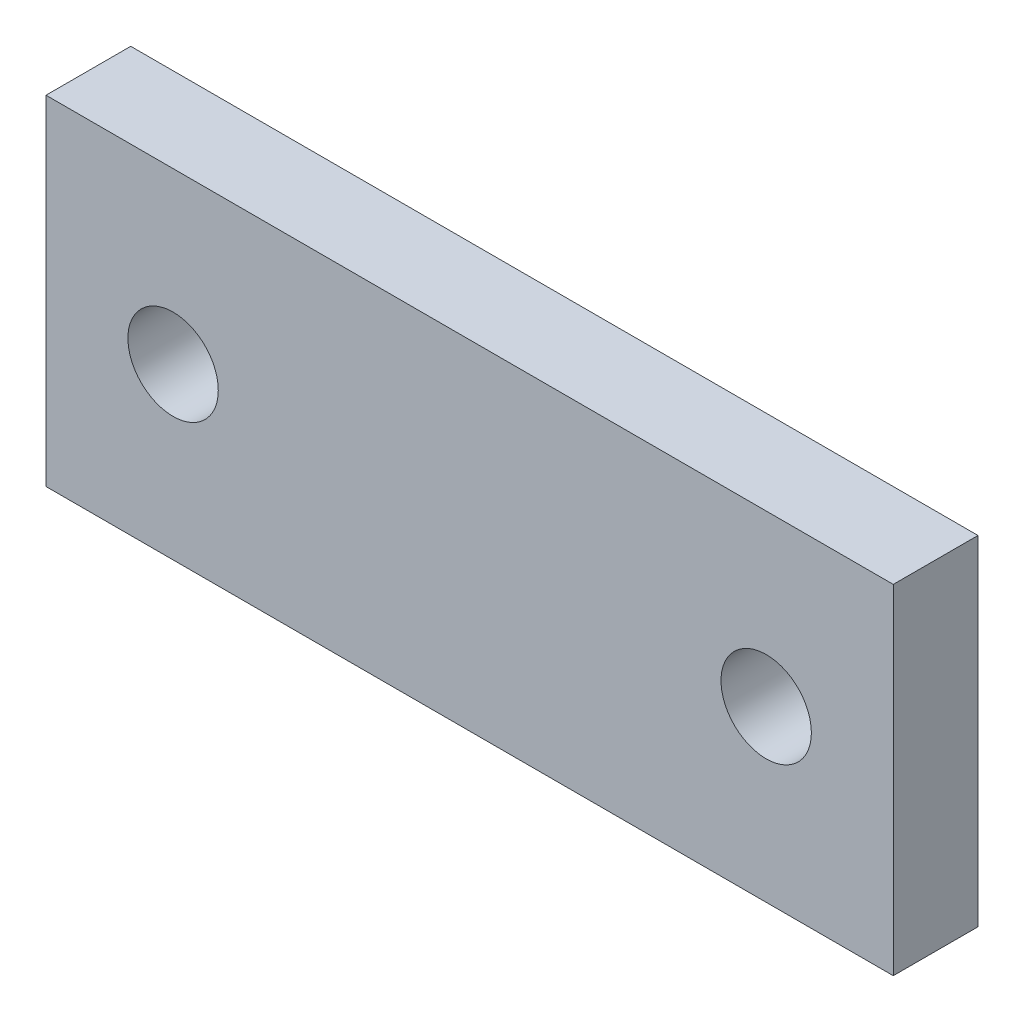
ISO-10303-21;
HEADER;
FILE_DESCRIPTION(('STEP AP214'),'2;1');
FILE_NAME('part.step','',(''),(''),'','','');
FILE_SCHEMA(('AUTOMOTIVE_DESIGN { 1 0 10303 214 1 1 1 1 }'));
ENDSEC;
DATA;
#1=APPLICATION_CONTEXT('core data for automotive mechanical design processes');
#2=APPLICATION_PROTOCOL_DEFINITION('international standard','automotive_design',2000,#1);
#3=PRODUCT_CONTEXT('',#1,'mechanical');
#4=PRODUCT('Part','Part','',(#3));
#5=PRODUCT_RELATED_PRODUCT_CATEGORY('part','',(#4));
#6=PRODUCT_DEFINITION_FORMATION('','',#4);
#7=PRODUCT_DEFINITION_CONTEXT('part definition',#1,'design');
#8=PRODUCT_DEFINITION('design','',#6,#7);
#9=PRODUCT_DEFINITION_SHAPE('','',#8);
#10=(LENGTH_UNIT() NAMED_UNIT(*) SI_UNIT(.MILLI.,.METRE.));
#11=(NAMED_UNIT(*) PLANE_ANGLE_UNIT() SI_UNIT($,.RADIAN.));
#12=(NAMED_UNIT(*) SI_UNIT($,.STERADIAN.) SOLID_ANGLE_UNIT());
#13=UNCERTAINTY_MEASURE_WITH_UNIT(LENGTH_MEASURE(1.E-05),#10,'distance_accuracy_value','');
#14=(GEOMETRIC_REPRESENTATION_CONTEXT(3) GLOBAL_UNCERTAINTY_ASSIGNED_CONTEXT((#13)) GLOBAL_UNIT_ASSIGNED_CONTEXT((#10,
#11,#12)) REPRESENTATION_CONTEXT('',''));
#15=CARTESIAN_POINT('',(0.,0.,0.));
#16=DIRECTION('',(0.,0.,1.));
#17=DIRECTION('',(1.,0.,0.));
#18=AXIS2_PLACEMENT_3D('',#15,#16,#17);
#19=CARTESIAN_POINT('',(0.,0.,3.));
#20=DIRECTION('',(0.,0.,1.));
#21=DIRECTION('',(1.,0.,0.));
#22=AXIS2_PLACEMENT_3D('',#19,#20,#21);
#23=PLANE('',#22);
#24=CARTESIAN_POINT('',(-0.780588843214674,6.,3.));
#25=DIRECTION('',(0.,0.,1.));
#26=DIRECTION('',(1.,0.,0.));
#27=AXIS2_PLACEMENT_3D('',#24,#25,#26);
#28=CIRCLE('',#27,1.6);
#29=CARTESIAN_POINT('',(0.819411156785326,6.,3.));
#30=VERTEX_POINT('',#29);
#31=EDGE_CURVE('E112',#30,#30,#28,.T.);
#32=ORIENTED_EDGE('',*,*,#31,.F.);
#33=EDGE_LOOP('',(#32));
#34=FACE_BOUND('',#33,.T.);
#35=DIRECTION('',(0.,1.,0.));
#36=VECTOR('',#35,1.);
#37=CARTESIAN_POINT('',(24.7194111567853,0.,3.));
#38=LINE('',#37,#36);
#39=CARTESIAN_POINT('',(24.7194111567853,0.,3.));
#40=VERTEX_POINT('',#39);
#41=CARTESIAN_POINT('',(24.7194111567853,12.,3.));
#42=VERTEX_POINT('',#41);
#43=EDGE_CURVE('E92',#40,#42,#38,.T.);
#44=ORIENTED_EDGE('',*,*,#43,.T.);
#45=DIRECTION('',(-1.,0.,0.));
#46=VECTOR('',#45,1.);
#47=CARTESIAN_POINT('',(24.7194111567853,12.,3.));
#48=LINE('',#47,#46);
#49=CARTESIAN_POINT('',(-5.28058884321467,12.,3.));
#50=VERTEX_POINT('',#49);
#51=EDGE_CURVE('E86',#42,#50,#48,.T.);
#52=ORIENTED_EDGE('',*,*,#51,.T.);
#53=DIRECTION('',(0.,-1.,0.));
#54=VECTOR('',#53,1.);
#55=CARTESIAN_POINT('',(-5.28058884321467,0.,3.));
#56=LINE('',#55,#54);
#57=CARTESIAN_POINT('',(-5.28058884321467,0.,3.));
#58=VERTEX_POINT('',#57);
#59=EDGE_CURVE('E90',#50,#58,#56,.T.);
#60=ORIENTED_EDGE('',*,*,#59,.T.);
#61=DIRECTION('',(1.,0.,0.));
#62=VECTOR('',#61,1.);
#63=CARTESIAN_POINT('',(24.7194111567853,0.,3.));
#64=LINE('',#63,#62);
#65=EDGE_CURVE('E56',#58,#40,#64,.T.);
#66=ORIENTED_EDGE('',*,*,#65,.T.);
#67=EDGE_LOOP('',(#44,#52,#60,#66));
#68=FACE_BOUND('',#67,.T.);
#69=CARTESIAN_POINT('',(20.2194111567853,6.,3.));
#70=DIRECTION('',(0.,0.,1.));
#71=DIRECTION('',(1.,0.,0.));
#72=AXIS2_PLACEMENT_3D('',#69,#70,#71);
#73=CIRCLE('',#72,1.6);
#74=CARTESIAN_POINT('',(21.8194111567853,6.,3.));
#75=VERTEX_POINT('',#74);
#76=EDGE_CURVE('E129',#75,#75,#73,.T.);
#77=ORIENTED_EDGE('',*,*,#76,.F.);
#78=EDGE_LOOP('',(#77));
#79=FACE_BOUND('',#78,.T.);
#80=ADVANCED_FACE('F39',(#34,#68,#79),#23,.T.);
#81=CARTESIAN_POINT('',(0.,0.,0.));
#82=DIRECTION('',(0.,0.,1.));
#83=DIRECTION('',(1.,0.,0.));
#84=AXIS2_PLACEMENT_3D('',#81,#82,#83);
#85=PLANE('',#84);
#86=CARTESIAN_POINT('',(-0.780588843214674,6.,0.));
#87=DIRECTION('',(0.,0.,1.));
#88=DIRECTION('',(1.,0.,0.));
#89=AXIS2_PLACEMENT_3D('',#86,#87,#88);
#90=CIRCLE('',#89,1.6);
#91=CARTESIAN_POINT('',(0.819411156785326,6.,0.));
#92=VERTEX_POINT('',#91);
#93=EDGE_CURVE('E125',#92,#92,#90,.T.);
#94=ORIENTED_EDGE('',*,*,#93,.T.);
#95=EDGE_LOOP('',(#94));
#96=FACE_BOUND('',#95,.T.);
#97=DIRECTION('',(0.,1.,0.));
#98=VECTOR('',#97,1.);
#99=CARTESIAN_POINT('',(24.7194111567853,0.,0.));
#100=LINE('',#99,#98);
#101=CARTESIAN_POINT('',(24.7194111567853,0.,0.));
#102=VERTEX_POINT('',#101);
#103=CARTESIAN_POINT('',(24.7194111567853,12.,0.));
#104=VERTEX_POINT('',#103);
#105=EDGE_CURVE('E109',#102,#104,#100,.T.);
#106=ORIENTED_EDGE('',*,*,#105,.F.);
#107=DIRECTION('',(1.,0.,0.));
#108=VECTOR('',#107,1.);
#109=CARTESIAN_POINT('',(24.7194111567853,0.,0.));
#110=LINE('',#109,#108);
#111=CARTESIAN_POINT('',(-5.28058884321467,0.,0.));
#112=VERTEX_POINT('',#111);
#113=EDGE_CURVE('E79',#112,#102,#110,.T.);
#114=ORIENTED_EDGE('',*,*,#113,.F.);
#115=DIRECTION('',(0.,-1.,0.));
#116=VECTOR('',#115,1.);
#117=CARTESIAN_POINT('',(-5.28058884321467,0.,0.));
#118=LINE('',#117,#116);
#119=CARTESIAN_POINT('',(-5.28058884321467,12.,0.));
#120=VERTEX_POINT('',#119);
#121=EDGE_CURVE('E73',#120,#112,#118,.T.);
#122=ORIENTED_EDGE('',*,*,#121,.F.);
#123=DIRECTION('',(-1.,0.,0.));
#124=VECTOR('',#123,1.);
#125=CARTESIAN_POINT('',(24.7194111567853,12.,0.));
#126=LINE('',#125,#124);
#127=EDGE_CURVE('E97',#104,#120,#126,.T.);
#128=ORIENTED_EDGE('',*,*,#127,.F.);
#129=EDGE_LOOP('',(#106,#114,#122,#128));
#130=FACE_BOUND('',#129,.T.);
#131=CARTESIAN_POINT('',(20.2194111567853,6.,0.));
#132=DIRECTION('',(0.,0.,1.));
#133=DIRECTION('',(1.,0.,0.));
#134=AXIS2_PLACEMENT_3D('',#131,#132,#133);
#135=CIRCLE('',#134,1.6);
#136=CARTESIAN_POINT('',(21.8194111567853,6.,0.));
#137=VERTEX_POINT('',#136);
#138=EDGE_CURVE('E133',#137,#137,#135,.T.);
#139=ORIENTED_EDGE('',*,*,#138,.T.);
#140=EDGE_LOOP('',(#139));
#141=FACE_BOUND('',#140,.T.);
#142=ADVANCED_FACE('F121',(#96,#130,#141),#85,.F.);
#143=CARTESIAN_POINT('',(24.7194111567853,0.,3.));
#144=DIRECTION('',(-1.,0.,0.));
#145=DIRECTION('',(0.,0.,1.));
#146=AXIS2_PLACEMENT_3D('',#143,#144,#145);
#147=PLANE('',#146);
#148=ORIENTED_EDGE('',*,*,#105,.T.);
#149=DIRECTION('',(0.,0.,-1.));
#150=VECTOR('',#149,1.);
#151=CARTESIAN_POINT('',(24.7194111567853,12.,3.));
#152=LINE('',#151,#150);
#153=EDGE_CURVE('E11',#42,#104,#152,.T.);
#154=ORIENTED_EDGE('',*,*,#153,.F.);
#155=ORIENTED_EDGE('',*,*,#43,.F.);
#156=DIRECTION('',(0.,0.,-1.));
#157=VECTOR('',#156,1.);
#158=CARTESIAN_POINT('',(24.7194111567853,0.,3.));
#159=LINE('',#158,#157);
#160=EDGE_CURVE('E105',#40,#102,#159,.T.);
#161=ORIENTED_EDGE('',*,*,#160,.T.);
#162=EDGE_LOOP('',(#148,#154,#155,#161));
#163=FACE_BOUND('',#162,.T.);
#164=ADVANCED_FACE('F41',(#163),#147,.F.);
#165=CARTESIAN_POINT('',(24.7194111567853,12.,3.));
#166=DIRECTION('',(0.,-1.,0.));
#167=DIRECTION('',(0.,0.,-1.));
#168=AXIS2_PLACEMENT_3D('',#165,#166,#167);
#169=PLANE('',#168);
#170=ORIENTED_EDGE('',*,*,#127,.T.);
#171=DIRECTION('',(0.,0.,-1.));
#172=VECTOR('',#171,1.);
#173=CARTESIAN_POINT('',(-5.28058884321467,12.,3.));
#174=LINE('',#173,#172);
#175=EDGE_CURVE('E48',#50,#120,#174,.T.);
#176=ORIENTED_EDGE('',*,*,#175,.F.);
#177=ORIENTED_EDGE('',*,*,#51,.F.);
#178=ORIENTED_EDGE('',*,*,#153,.T.);
#179=EDGE_LOOP('',(#170,#176,#177,#178));
#180=FACE_BOUND('',#179,.T.);
#181=ADVANCED_FACE('F96',(#180),#169,.F.);
#182=CARTESIAN_POINT('',(-5.28058884321467,0.,3.));
#183=DIRECTION('',(1.,0.,0.));
#184=DIRECTION('',(0.,0.,-1.));
#185=AXIS2_PLACEMENT_3D('',#182,#183,#184);
#186=PLANE('',#185);
#187=ORIENTED_EDGE('',*,*,#121,.T.);
#188=DIRECTION('',(0.,0.,-1.));
#189=VECTOR('',#188,1.);
#190=CARTESIAN_POINT('',(-5.28058884321467,0.,3.));
#191=LINE('',#190,#189);
#192=EDGE_CURVE('E99',#58,#112,#191,.T.);
#193=ORIENTED_EDGE('',*,*,#192,.F.);
#194=ORIENTED_EDGE('',*,*,#59,.F.);
#195=ORIENTED_EDGE('',*,*,#175,.T.);
#196=EDGE_LOOP('',(#187,#193,#194,#195));
#197=FACE_BOUND('',#196,.T.);
#198=ADVANCED_FACE('F100',(#197),#186,.F.);
#199=CARTESIAN_POINT('',(24.7194111567853,0.,3.));
#200=DIRECTION('',(0.,1.,0.));
#201=DIRECTION('',(0.,0.,1.));
#202=AXIS2_PLACEMENT_3D('',#199,#200,#201);
#203=PLANE('',#202);
#204=ORIENTED_EDGE('',*,*,#113,.T.);
#205=ORIENTED_EDGE('',*,*,#160,.F.);
#206=ORIENTED_EDGE('',*,*,#65,.F.);
#207=ORIENTED_EDGE('',*,*,#192,.T.);
#208=EDGE_LOOP('',(#204,#205,#206,#207));
#209=FACE_BOUND('',#208,.T.);
#210=ADVANCED_FACE('F118',(#209),#203,.F.);
#211=CARTESIAN_POINT('',(-0.780588843214674,6.,3.));
#212=DIRECTION('',(0.,0.,-1.));
#213=DIRECTION('',(-1.,0.,0.));
#214=AXIS2_PLACEMENT_3D('',#211,#212,#213);
#215=CYLINDRICAL_SURFACE('',#214,1.6);
#216=ORIENTED_EDGE('',*,*,#31,.T.);
#217=EDGE_LOOP('',(#216));
#218=FACE_BOUND('',#217,.T.);
#219=ORIENTED_EDGE('',*,*,#93,.F.);
#220=EDGE_LOOP('',(#219));
#221=FACE_BOUND('',#220,.T.);
#222=ADVANCED_FACE('F151',(#218,#221),#215,.F.);
#223=CARTESIAN_POINT('',(20.2194111567853,6.,3.));
#224=DIRECTION('',(0.,0.,-1.));
#225=DIRECTION('',(-1.,0.,0.));
#226=AXIS2_PLACEMENT_3D('',#223,#224,#225);
#227=CYLINDRICAL_SURFACE('',#226,1.6);
#228=ORIENTED_EDGE('',*,*,#76,.T.);
#229=EDGE_LOOP('',(#228));
#230=FACE_BOUND('',#229,.T.);
#231=ORIENTED_EDGE('',*,*,#138,.F.);
#232=EDGE_LOOP('',(#231));
#233=FACE_BOUND('',#232,.T.);
#234=ADVANCED_FACE('F139',(#230,#233),#227,.F.);
#235=CLOSED_SHELL('',(#80,#142,#164,#181,#198,#210,#222,#234));
#236=MANIFOLD_SOLID_BREP('B2',#235);
#237=ADVANCED_BREP_SHAPE_REPRESENTATION('',(#18,#236),#14);
#238=SHAPE_DEFINITION_REPRESENTATION(#9,#237);
ENDSEC;
END-ISO-10303-21;
